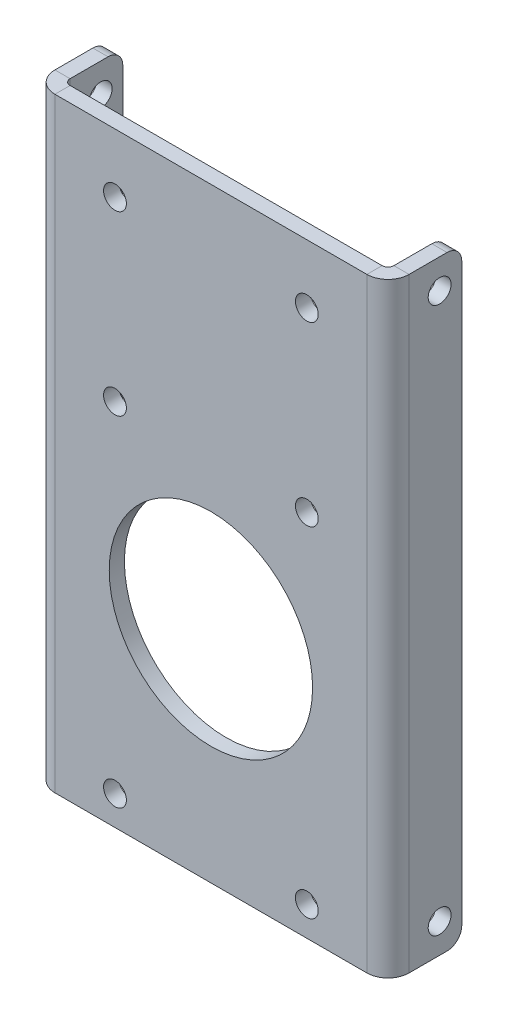
ISO-10303-21;
HEADER;
FILE_DESCRIPTION(('STEP AP214'),'2;1');
FILE_NAME('part.step','',(''),(''),'','','');
FILE_SCHEMA(('AUTOMOTIVE_DESIGN { 1 0 10303 214 1 1 1 1 }'));
ENDSEC;
DATA;
#1=APPLICATION_CONTEXT('core data for automotive mechanical design processes');
#2=APPLICATION_PROTOCOL_DEFINITION('international standard','automotive_design',2000,#1);
#3=PRODUCT_CONTEXT('',#1,'mechanical');
#4=PRODUCT('Part','Part','',(#3));
#5=PRODUCT_RELATED_PRODUCT_CATEGORY('part','',(#4));
#6=PRODUCT_DEFINITION_FORMATION('','',#4);
#7=PRODUCT_DEFINITION_CONTEXT('part definition',#1,'design');
#8=PRODUCT_DEFINITION('design','',#6,#7);
#9=PRODUCT_DEFINITION_SHAPE('','',#8);
#10=(LENGTH_UNIT() NAMED_UNIT(*) SI_UNIT(.MILLI.,.METRE.));
#11=(NAMED_UNIT(*) PLANE_ANGLE_UNIT() SI_UNIT($,.RADIAN.));
#12=(NAMED_UNIT(*) SI_UNIT($,.STERADIAN.) SOLID_ANGLE_UNIT());
#13=UNCERTAINTY_MEASURE_WITH_UNIT(LENGTH_MEASURE(1.E-05),#10,'distance_accuracy_value','');
#14=(GEOMETRIC_REPRESENTATION_CONTEXT(3) GLOBAL_UNCERTAINTY_ASSIGNED_CONTEXT((#13)) GLOBAL_UNIT_ASSIGNED_CONTEXT((#10,
#11,#12)) REPRESENTATION_CONTEXT('',''));
#15=CARTESIAN_POINT('',(0.,0.,0.));
#16=DIRECTION('',(0.,0.,1.));
#17=DIRECTION('',(1.,0.,0.));
#18=AXIS2_PLACEMENT_3D('',#15,#16,#17);
#19=CARTESIAN_POINT('',(0.,0.,-3.2639));
#20=DIRECTION('',(0.,0.,1.));
#21=DIRECTION('',(1.,0.,0.));
#22=AXIS2_PLACEMENT_3D('',#19,#20,#21);
#23=PLANE('',#22);
#24=CARTESIAN_POINT('',(-20.6375,70.146418,-3.2639));
#25=DIRECTION('',(0.,0.,1.));
#26=DIRECTION('',(1.,0.,0.));
#27=AXIS2_PLACEMENT_3D('',#24,#25,#26);
#28=CIRCLE('',#27,2.45744999999999);
#29=CARTESIAN_POINT('',(-18.18005,70.146418,-3.2639));
#30=VERTEX_POINT('',#29);
#31=EDGE_CURVE('E532',#30,#30,#28,.T.);
#32=ORIENTED_EDGE('',*,*,#31,.T.);
#33=EDGE_LOOP('',(#32));
#34=FACE_BOUND('',#33,.T.);
#35=CARTESIAN_POINT('',(20.6375,70.146418,-3.2639));
#36=DIRECTION('',(0.,0.,1.));
#37=DIRECTION('',(1.,0.,0.));
#38=AXIS2_PLACEMENT_3D('',#35,#36,#37);
#39=CIRCLE('',#38,2.45744999999999);
#40=CARTESIAN_POINT('',(23.09495,70.146418,-3.2639));
#41=VERTEX_POINT('',#40);
#42=EDGE_CURVE('E542',#41,#41,#39,.T.);
#43=ORIENTED_EDGE('',*,*,#42,.T.);
#44=EDGE_LOOP('',(#43));
#45=FACE_BOUND('',#44,.T.);
#46=CARTESIAN_POINT('',(20.6375,32.046418,-3.2639));
#47=DIRECTION('',(0.,0.,1.));
#48=DIRECTION('',(1.,0.,0.));
#49=AXIS2_PLACEMENT_3D('',#46,#47,#48);
#50=CIRCLE('',#49,2.45744999999999);
#51=CARTESIAN_POINT('',(23.09495,32.046418,-3.2639));
#52=VERTEX_POINT('',#51);
#53=EDGE_CURVE('E548',#52,#52,#50,.T.);
#54=ORIENTED_EDGE('',*,*,#53,.T.);
#55=EDGE_LOOP('',(#54));
#56=FACE_BOUND('',#55,.T.);
#57=CARTESIAN_POINT('',(-20.6375,32.046418,-3.2639));
#58=DIRECTION('',(0.,0.,1.));
#59=DIRECTION('',(1.,0.,0.));
#60=AXIS2_PLACEMENT_3D('',#57,#58,#59);
#61=CIRCLE('',#60,2.45744999999999);
#62=CARTESIAN_POINT('',(-18.18005,32.046418,-3.2639));
#63=VERTEX_POINT('',#62);
#64=EDGE_CURVE('E554',#63,#63,#61,.T.);
#65=ORIENTED_EDGE('',*,*,#64,.T.);
#66=EDGE_LOOP('',(#65));
#67=FACE_BOUND('',#66,.T.);
#68=CARTESIAN_POINT('',(-20.6375,-40.978582,-3.2639));
#69=DIRECTION('',(0.,0.,1.));
#70=DIRECTION('',(1.,0.,0.));
#71=AXIS2_PLACEMENT_3D('',#68,#69,#70);
#72=CIRCLE('',#71,2.45744999999999);
#73=CARTESIAN_POINT('',(-18.18005,-40.978582,-3.2639));
#74=VERTEX_POINT('',#73);
#75=EDGE_CURVE('E560',#74,#74,#72,.T.);
#76=ORIENTED_EDGE('',*,*,#75,.T.);
#77=EDGE_LOOP('',(#76));
#78=FACE_BOUND('',#77,.T.);
#79=CARTESIAN_POINT('',(20.6375,-40.978582,-3.2639));
#80=DIRECTION('',(0.,0.,1.));
#81=DIRECTION('',(1.,0.,0.));
#82=AXIS2_PLACEMENT_3D('',#79,#80,#81);
#83=CIRCLE('',#82,2.45744999999999);
#84=CARTESIAN_POINT('',(23.09495,-40.978582,-3.2639));
#85=VERTEX_POINT('',#84);
#86=EDGE_CURVE('E566',#85,#85,#83,.T.);
#87=ORIENTED_EDGE('',*,*,#86,.T.);
#88=EDGE_LOOP('',(#87));
#89=FACE_BOUND('',#88,.T.);
#90=CARTESIAN_POINT('',(0.,0.,-3.2639));
#91=DIRECTION('',(0.,0.,-1.));
#92=DIRECTION('',(-1.,0.,0.));
#93=AXIS2_PLACEMENT_3D('',#90,#91,#92);
#94=CIRCLE('',#93,21.87575);
#95=CARTESIAN_POINT('',(-21.87575,0.,-3.2639));
#96=VERTEX_POINT('',#95);
#97=EDGE_CURVE('E569',#96,#96,#94,.T.);
#98=ORIENTED_EDGE('',*,*,#97,.F.);
#99=EDGE_LOOP('',(#98));
#100=FACE_BOUND('',#99,.T.);
#101=DIRECTION('',(0.,1.,0.));
#102=VECTOR('',#101,1.);
#103=CARTESIAN_POINT('',(-33.5661,82.846418,-3.2639));
#104=LINE('',#103,#102);
#105=CARTESIAN_POINT('',(-33.5661,82.846418,-3.2639));
#106=VERTEX_POINT('',#105);
#107=CARTESIAN_POINT('',(-33.5661,-47.328582,-3.2639));
#108=VERTEX_POINT('',#107);
#109=EDGE_CURVE('E250',#106,#108,#104,.F.);
#110=ORIENTED_EDGE('',*,*,#109,.F.);
#111=DIRECTION('',(-1.,0.,0.));
#112=VECTOR('',#111,1.);
#113=CARTESIAN_POINT('',(-38.1,82.846418,-3.2639));
#114=LINE('',#113,#112);
#115=CARTESIAN_POINT('',(33.5661,82.846418,-3.2639));
#116=VERTEX_POINT('',#115);
#117=EDGE_CURVE('E311',#116,#106,#114,.T.);
#118=ORIENTED_EDGE('',*,*,#117,.F.);
#119=DIRECTION('',(0.,-1.,0.));
#120=VECTOR('',#119,1.);
#121=CARTESIAN_POINT('',(33.5661,-47.328582,-3.26390000000004));
#122=LINE('',#121,#120);
#123=CARTESIAN_POINT('',(33.5661,-47.328582,-3.26390000000004));
#124=VERTEX_POINT('',#123);
#125=EDGE_CURVE('E298',#124,#116,#122,.F.);
#126=ORIENTED_EDGE('',*,*,#125,.F.);
#127=DIRECTION('',(1.,0.,0.));
#128=VECTOR('',#127,1.);
#129=CARTESIAN_POINT('',(-38.1,-47.328582,-3.2639));
#130=LINE('',#129,#128);
#131=EDGE_CURVE('E308',#108,#124,#130,.T.);
#132=ORIENTED_EDGE('',*,*,#131,.F.);
#133=EDGE_LOOP('',(#110,#118,#126,#132));
#134=FACE_BOUND('',#133,.T.);
#135=ADVANCED_FACE('F83',(#34,#45,#56,#67,#78,#89,#100,#134),#23,.F.);
#136=CARTESIAN_POINT('',(0.,0.,0.));
#137=DIRECTION('',(0.,0.,1.));
#138=DIRECTION('',(1.,0.,0.));
#139=AXIS2_PLACEMENT_3D('',#136,#137,#138);
#140=PLANE('',#139);
#141=CARTESIAN_POINT('',(-20.6375,70.146418,0.));
#142=DIRECTION('',(0.,0.,1.));
#143=DIRECTION('',(1.,0.,0.));
#144=AXIS2_PLACEMENT_3D('',#141,#142,#143);
#145=CIRCLE('',#144,2.45744999999999);
#146=CARTESIAN_POINT('',(-18.18005,70.146418,0.));
#147=VERTEX_POINT('',#146);
#148=EDGE_CURVE('E535',#147,#147,#145,.T.);
#149=ORIENTED_EDGE('',*,*,#148,.F.);
#150=EDGE_LOOP('',(#149));
#151=FACE_BOUND('',#150,.T.);
#152=CARTESIAN_POINT('',(20.6375,70.146418,0.));
#153=DIRECTION('',(0.,0.,1.));
#154=DIRECTION('',(1.,0.,0.));
#155=AXIS2_PLACEMENT_3D('',#152,#153,#154);
#156=CIRCLE('',#155,2.45744999999999);
#157=CARTESIAN_POINT('',(23.09495,70.146418,0.));
#158=VERTEX_POINT('',#157);
#159=EDGE_CURVE('E537',#158,#158,#156,.T.);
#160=ORIENTED_EDGE('',*,*,#159,.F.);
#161=EDGE_LOOP('',(#160));
#162=FACE_BOUND('',#161,.T.);
#163=CARTESIAN_POINT('',(20.6375,32.046418,0.));
#164=DIRECTION('',(0.,0.,1.));
#165=DIRECTION('',(1.,0.,0.));
#166=AXIS2_PLACEMENT_3D('',#163,#164,#165);
#167=CIRCLE('',#166,2.45744999999999);
#168=CARTESIAN_POINT('',(23.09495,32.046418,0.));
#169=VERTEX_POINT('',#168);
#170=EDGE_CURVE('E545',#169,#169,#167,.T.);
#171=ORIENTED_EDGE('',*,*,#170,.F.);
#172=EDGE_LOOP('',(#171));
#173=FACE_BOUND('',#172,.T.);
#174=CARTESIAN_POINT('',(-20.6375,32.046418,0.));
#175=DIRECTION('',(0.,0.,1.));
#176=DIRECTION('',(1.,0.,0.));
#177=AXIS2_PLACEMENT_3D('',#174,#175,#176);
#178=CIRCLE('',#177,2.45744999999999);
#179=CARTESIAN_POINT('',(-18.18005,32.046418,0.));
#180=VERTEX_POINT('',#179);
#181=EDGE_CURVE('E551',#180,#180,#178,.T.);
#182=ORIENTED_EDGE('',*,*,#181,.F.);
#183=EDGE_LOOP('',(#182));
#184=FACE_BOUND('',#183,.T.);
#185=CARTESIAN_POINT('',(-20.6375,-40.978582,0.));
#186=DIRECTION('',(0.,0.,1.));
#187=DIRECTION('',(1.,0.,0.));
#188=AXIS2_PLACEMENT_3D('',#185,#186,#187);
#189=CIRCLE('',#188,2.45744999999999);
#190=CARTESIAN_POINT('',(-18.18005,-40.978582,0.));
#191=VERTEX_POINT('',#190);
#192=EDGE_CURVE('E557',#191,#191,#189,.T.);
#193=ORIENTED_EDGE('',*,*,#192,.F.);
#194=EDGE_LOOP('',(#193));
#195=FACE_BOUND('',#194,.T.);
#196=CARTESIAN_POINT('',(20.6375,-40.978582,0.));
#197=DIRECTION('',(0.,0.,1.));
#198=DIRECTION('',(1.,0.,0.));
#199=AXIS2_PLACEMENT_3D('',#196,#197,#198);
#200=CIRCLE('',#199,2.45744999999999);
#201=CARTESIAN_POINT('',(23.09495,-40.978582,0.));
#202=VERTEX_POINT('',#201);
#203=EDGE_CURVE('E563',#202,#202,#200,.T.);
#204=ORIENTED_EDGE('',*,*,#203,.F.);
#205=EDGE_LOOP('',(#204));
#206=FACE_BOUND('',#205,.T.);
#207=CARTESIAN_POINT('',(0.,0.,0.));
#208=DIRECTION('',(0.,0.,-1.));
#209=DIRECTION('',(-1.,0.,0.));
#210=AXIS2_PLACEMENT_3D('',#207,#208,#209);
#211=CIRCLE('',#210,21.87575);
#212=CARTESIAN_POINT('',(-21.87575,0.,0.));
#213=VERTEX_POINT('',#212);
#214=EDGE_CURVE('E570',#213,#213,#211,.T.);
#215=ORIENTED_EDGE('',*,*,#214,.T.);
#216=EDGE_LOOP('',(#215));
#217=FACE_BOUND('',#216,.T.);
#218=DIRECTION('',(-1.,0.,0.));
#219=VECTOR('',#218,1.);
#220=CARTESIAN_POINT('',(-38.1,82.846418,0.));
#221=LINE('',#220,#219);
#222=CARTESIAN_POINT('',(33.5661,82.846418,0.));
#223=VERTEX_POINT('',#222);
#224=CARTESIAN_POINT('',(-33.5661,82.846418,0.));
#225=VERTEX_POINT('',#224);
#226=EDGE_CURVE('E312',#223,#225,#221,.T.);
#227=ORIENTED_EDGE('',*,*,#226,.T.);
#228=DIRECTION('',(0.,1.,0.));
#229=VECTOR('',#228,1.);
#230=CARTESIAN_POINT('',(-33.5661,82.846418,0.));
#231=LINE('',#230,#229);
#232=CARTESIAN_POINT('',(-33.5661,-47.328582,0.));
#233=VERTEX_POINT('',#232);
#234=EDGE_CURVE('E217',#225,#233,#231,.F.);
#235=ORIENTED_EDGE('',*,*,#234,.T.);
#236=DIRECTION('',(1.,0.,0.));
#237=VECTOR('',#236,1.);
#238=CARTESIAN_POINT('',(-38.1,-47.328582,0.));
#239=LINE('',#238,#237);
#240=CARTESIAN_POINT('',(33.5661,-47.328582,0.));
#241=VERTEX_POINT('',#240);
#242=EDGE_CURVE('E305',#233,#241,#239,.T.);
#243=ORIENTED_EDGE('',*,*,#242,.T.);
#244=DIRECTION('',(0.,-1.,0.));
#245=VECTOR('',#244,1.);
#246=CARTESIAN_POINT('',(33.5661,-47.328582,0.));
#247=LINE('',#246,#245);
#248=EDGE_CURVE('E285',#241,#223,#247,.F.);
#249=ORIENTED_EDGE('',*,*,#248,.T.);
#250=EDGE_LOOP('',(#227,#235,#243,#249));
#251=FACE_BOUND('',#250,.T.);
#252=ADVANCED_FACE('F395',(#151,#162,#173,#184,#195,#206,#217,#251),#140,.T.);
#253=CARTESIAN_POINT('',(-38.1,82.846418,-3.2639));
#254=DIRECTION('',(0.,1.,0.));
#255=DIRECTION('',(-1.,0.,0.));
#256=AXIS2_PLACEMENT_3D('',#253,#254,#255);
#257=PLANE('',#256);
#258=ORIENTED_EDGE('',*,*,#117,.T.);
#259=DIRECTION('',(0.,0.,1.));
#260=VECTOR('',#259,1.);
#261=CARTESIAN_POINT('',(-33.5661,82.846418,-3.2639));
#262=LINE('',#261,#260);
#263=EDGE_CURVE('E246',#106,#225,#262,.T.);
#264=ORIENTED_EDGE('',*,*,#263,.T.);
#265=ORIENTED_EDGE('',*,*,#226,.F.);
#266=DIRECTION('',(0.,0.,1.));
#267=VECTOR('',#266,1.);
#268=CARTESIAN_POINT('',(33.5661,82.846418,-3.2639));
#269=LINE('',#268,#267);
#270=EDGE_CURVE('E302',#116,#223,#269,.T.);
#271=ORIENTED_EDGE('',*,*,#270,.F.);
#272=EDGE_LOOP('',(#258,#264,#265,#271));
#273=FACE_BOUND('',#272,.T.);
#274=ADVANCED_FACE('F393',(#273),#257,.T.);
#275=CARTESIAN_POINT('',(-38.1,-47.328582,-3.2639));
#276=DIRECTION('',(0.,-1.,0.));
#277=DIRECTION('',(1.,0.,0.));
#278=AXIS2_PLACEMENT_3D('',#275,#276,#277);
#279=PLANE('',#278);
#280=DIRECTION('',(0.,0.,1.));
#281=VECTOR('',#280,1.);
#282=CARTESIAN_POINT('',(-33.5661,-47.328582,-3.2639));
#283=LINE('',#282,#281);
#284=EDGE_CURVE('E253',#108,#233,#283,.T.);
#285=ORIENTED_EDGE('',*,*,#284,.F.);
#286=ORIENTED_EDGE('',*,*,#131,.T.);
#287=DIRECTION('',(0.,0.,1.));
#288=VECTOR('',#287,1.);
#289=CARTESIAN_POINT('',(33.5661,-47.328582,-3.26390000000004));
#290=LINE('',#289,#288);
#291=EDGE_CURVE('E292',#124,#241,#290,.T.);
#292=ORIENTED_EDGE('',*,*,#291,.T.);
#293=ORIENTED_EDGE('',*,*,#242,.F.);
#294=EDGE_LOOP('',(#285,#286,#292,#293));
#295=FACE_BOUND('',#294,.T.);
#296=ADVANCED_FACE('F379',(#295),#279,.T.);
#297=CARTESIAN_POINT('',(33.5661,82.846418,-4.53389999999998));
#298=DIRECTION('',(0.,1.,0.));
#299=DIRECTION('',(0.,0.,1.));
#300=AXIS2_PLACEMENT_3D('',#297,#298,#299);
#301=PLANE('',#300);
#302=DIRECTION('',(1.,0.,0.));
#303=VECTOR('',#302,1.);
#304=CARTESIAN_POINT('',(38.1,82.846418,-4.53389999999998));
#305=LINE('',#304,#303);
#306=CARTESIAN_POINT('',(34.8361,82.846418,-4.53389999999998));
#307=VERTEX_POINT('',#306);
#308=CARTESIAN_POINT('',(38.1,82.846418,-4.53389999999996));
#309=VERTEX_POINT('',#308);
#310=EDGE_CURVE('E256',#307,#309,#305,.T.);
#311=ORIENTED_EDGE('',*,*,#310,.F.);
#312=CARTESIAN_POINT('',(33.5661,82.846418,-4.53389999999998));
#313=DIRECTION('',(0.,-1.,0.));
#314=DIRECTION('',(0.,0.,-1.));
#315=AXIS2_PLACEMENT_3D('',#312,#313,#314);
#316=CIRCLE('',#315,1.26999999999999);
#317=EDGE_CURVE('E295',#116,#307,#316,.F.);
#318=ORIENTED_EDGE('',*,*,#317,.F.);
#319=ORIENTED_EDGE('',*,*,#270,.T.);
#320=CARTESIAN_POINT('',(33.5661,82.846418,-4.53389999999998));
#321=DIRECTION('',(0.,-1.,0.));
#322=DIRECTION('',(0.,0.,-1.));
#323=AXIS2_PLACEMENT_3D('',#320,#321,#322);
#324=CIRCLE('',#323,4.53389999999999);
#325=EDGE_CURVE('E288',#223,#309,#324,.F.);
#326=ORIENTED_EDGE('',*,*,#325,.T.);
#327=EDGE_LOOP('',(#311,#318,#319,#326));
#328=FACE_BOUND('',#327,.T.);
#329=ADVANCED_FACE('F390',(#328),#301,.T.);
#330=CARTESIAN_POINT('',(33.5661,-47.328582,-4.53390000000003));
#331=DIRECTION('',(0.,1.,0.));
#332=DIRECTION('',(0.,0.,1.));
#333=AXIS2_PLACEMENT_3D('',#330,#331,#332);
#334=PLANE('',#333);
#335=CARTESIAN_POINT('',(33.5661,-47.328582,-4.53390000000003));
#336=DIRECTION('',(0.,-1.,0.));
#337=DIRECTION('',(0.,0.,-1.));
#338=AXIS2_PLACEMENT_3D('',#335,#336,#337);
#339=CIRCLE('',#338,1.26999999999999);
#340=CARTESIAN_POINT('',(34.8361,-47.328582,-4.53390000000002));
#341=VERTEX_POINT('',#340);
#342=EDGE_CURVE('E260',#341,#124,#339,.T.);
#343=ORIENTED_EDGE('',*,*,#342,.F.);
#344=DIRECTION('',(1.,0.,0.));
#345=VECTOR('',#344,1.);
#346=CARTESIAN_POINT('',(34.8361,-47.328582,-4.53390000000001));
#347=LINE('',#346,#345);
#348=CARTESIAN_POINT('',(38.1,-47.328582,-4.5339));
#349=VERTEX_POINT('',#348);
#350=EDGE_CURVE('E277',#341,#349,#347,.T.);
#351=ORIENTED_EDGE('',*,*,#350,.T.);
#352=CARTESIAN_POINT('',(33.5661,-47.328582,-4.53390000000003));
#353=DIRECTION('',(0.,-1.,0.));
#354=DIRECTION('',(0.,0.,-1.));
#355=AXIS2_PLACEMENT_3D('',#352,#353,#354);
#356=CIRCLE('',#355,4.53389999999999);
#357=EDGE_CURVE('E289',#349,#241,#356,.T.);
#358=ORIENTED_EDGE('',*,*,#357,.T.);
#359=ORIENTED_EDGE('',*,*,#291,.F.);
#360=EDGE_LOOP('',(#343,#351,#358,#359));
#361=FACE_BOUND('',#360,.T.);
#362=ADVANCED_FACE('F400',(#361),#334,.F.);
#363=CARTESIAN_POINT('',(33.5661,-47.328582,-4.53390000000003));
#364=DIRECTION('',(0.,-1.,0.));
#365=DIRECTION('',(1.,0.,0.));
#366=AXIS2_PLACEMENT_3D('',#363,#364,#365);
#367=CYLINDRICAL_SURFACE('',#366,4.53389999999999);
#368=ORIENTED_EDGE('',*,*,#248,.F.);
#369=ORIENTED_EDGE('',*,*,#357,.F.);
#370=DIRECTION('',(0.,-1.,0.));
#371=VECTOR('',#370,1.);
#372=CARTESIAN_POINT('',(38.1,0.,-4.53389999999999));
#373=LINE('',#372,#371);
#374=EDGE_CURVE('E274',#309,#349,#373,.T.);
#375=ORIENTED_EDGE('',*,*,#374,.F.);
#376=ORIENTED_EDGE('',*,*,#325,.F.);
#377=EDGE_LOOP('',(#368,#369,#375,#376));
#378=FACE_BOUND('',#377,.T.);
#379=ADVANCED_FACE('F398',(#378),#367,.T.);
#380=CARTESIAN_POINT('',(33.5661,-47.328582,-4.53390000000003));
#381=DIRECTION('',(0.,-1.,0.));
#382=DIRECTION('',(1.,0.,0.));
#383=AXIS2_PLACEMENT_3D('',#380,#381,#382);
#384=CYLINDRICAL_SURFACE('',#383,1.26999999999999);
#385=ORIENTED_EDGE('',*,*,#125,.T.);
#386=ORIENTED_EDGE('',*,*,#317,.T.);
#387=DIRECTION('',(0.,1.,0.));
#388=VECTOR('',#387,1.);
#389=CARTESIAN_POINT('',(34.8361,82.846418,-4.53389999999999));
#390=LINE('',#389,#388);
#391=EDGE_CURVE('E280',#307,#341,#390,.F.);
#392=ORIENTED_EDGE('',*,*,#391,.T.);
#393=ORIENTED_EDGE('',*,*,#342,.T.);
#394=EDGE_LOOP('',(#385,#386,#392,#393));
#395=FACE_BOUND('',#394,.T.);
#396=ADVANCED_FACE('F385',(#395),#384,.F.);
#397=CARTESIAN_POINT('',(38.1,-47.328582,-3.26389999999999));
#398=DIRECTION('',(0.,-1.,0.));
#399=DIRECTION('',(1.,0.,0.));
#400=AXIS2_PLACEMENT_3D('',#397,#398,#399);
#401=PLANE('',#400);
#402=DIRECTION('',(0.,0.,-1.));
#403=VECTOR('',#402,1.);
#404=CARTESIAN_POINT('',(34.8361,-47.328582,1.46743979840938E-13));
#405=LINE('',#404,#403);
#406=CARTESIAN_POINT('',(34.8361,-47.328582,-12.7));
#407=VERTEX_POINT('',#406);
#408=EDGE_CURVE('E266',#407,#341,#405,.F.);
#409=ORIENTED_EDGE('',*,*,#408,.F.);
#410=DIRECTION('',(-1.,0.,0.));
#411=VECTOR('',#410,1.);
#412=CARTESIAN_POINT('',(38.1,-47.328582,-12.7));
#413=LINE('',#412,#411);
#414=CARTESIAN_POINT('',(38.1,-47.328582,-12.7));
#415=VERTEX_POINT('',#414);
#416=EDGE_CURVE('E13',#407,#415,#413,.F.);
#417=ORIENTED_EDGE('',*,*,#416,.T.);
#418=DIRECTION('',(0.,0.,1.));
#419=VECTOR('',#418,1.);
#420=CARTESIAN_POINT('',(38.1,-47.328582,-3.26389999999999));
#421=LINE('',#420,#419);
#422=EDGE_CURVE('E258',#415,#349,#421,.T.);
#423=ORIENTED_EDGE('',*,*,#422,.T.);
#424=ORIENTED_EDGE('',*,*,#350,.F.);
#425=EDGE_LOOP('',(#409,#417,#423,#424));
#426=FACE_BOUND('',#425,.T.);
#427=ADVANCED_FACE('F411',(#426),#401,.T.);
#428=CARTESIAN_POINT('',(38.1,82.846418,-15.875));
#429=DIRECTION('',(0.,1.,0.));
#430=DIRECTION('',(-1.,0.,0.));
#431=AXIS2_PLACEMENT_3D('',#428,#429,#430);
#432=PLANE('',#431);
#433=DIRECTION('',(0.,0.,-1.));
#434=VECTOR('',#433,1.);
#435=CARTESIAN_POINT('',(38.1,82.846418,-15.875));
#436=LINE('',#435,#434);
#437=CARTESIAN_POINT('',(38.1,82.846418,-12.7));
#438=VERTEX_POINT('',#437);
#439=EDGE_CURVE('E263',#309,#438,#436,.T.);
#440=ORIENTED_EDGE('',*,*,#439,.T.);
#441=DIRECTION('',(-1.,0.,0.));
#442=VECTOR('',#441,1.);
#443=CARTESIAN_POINT('',(38.1,82.846418,-12.7));
#444=LINE('',#443,#442);
#445=CARTESIAN_POINT('',(34.8361,82.846418,-12.7));
#446=VERTEX_POINT('',#445);
#447=EDGE_CURVE('E342',#438,#446,#444,.T.);
#448=ORIENTED_EDGE('',*,*,#447,.T.);
#449=DIRECTION('',(0.,0.,1.));
#450=VECTOR('',#449,1.);
#451=CARTESIAN_POINT('',(34.8361,82.846418,1.46743979840938E-13));
#452=LINE('',#451,#450);
#453=EDGE_CURVE('E271',#307,#446,#452,.F.);
#454=ORIENTED_EDGE('',*,*,#453,.F.);
#455=ORIENTED_EDGE('',*,*,#310,.T.);
#456=EDGE_LOOP('',(#440,#448,#454,#455));
#457=FACE_BOUND('',#456,.T.);
#458=ADVANCED_FACE('F406',(#457),#432,.T.);
#459=CARTESIAN_POINT('',(38.1,0.,1.58139825782788E-13));
#460=DIRECTION('',(1.,0.,0.));
#461=DIRECTION('',(0.,0.,-1.));
#462=AXIS2_PLACEMENT_3D('',#459,#460,#461);
#463=PLANE('',#462);
#464=CARTESIAN_POINT('',(38.1,76.496418,-11.1125));
#465=DIRECTION('',(1.,0.,0.));
#466=DIRECTION('',(0.,0.,-1.));
#467=AXIS2_PLACEMENT_3D('',#464,#465,#466);
#468=CIRCLE('',#467,2.45745);
#469=CARTESIAN_POINT('',(38.1,76.496418,-13.56995));
#470=VERTEX_POINT('',#469);
#471=EDGE_CURVE('E573',#470,#470,#468,.T.);
#472=ORIENTED_EDGE('',*,*,#471,.F.);
#473=EDGE_LOOP('',(#472));
#474=FACE_BOUND('',#473,.T.);
#475=CARTESIAN_POINT('',(38.1,-40.978582,-11.1125));
#476=DIRECTION('',(1.,0.,0.));
#477=DIRECTION('',(0.,0.,-1.));
#478=AXIS2_PLACEMENT_3D('',#475,#476,#477);
#479=CIRCLE('',#478,2.45745);
#480=CARTESIAN_POINT('',(38.1,-40.978582,-13.56995));
#481=VERTEX_POINT('',#480);
#482=EDGE_CURVE('E582',#481,#481,#479,.T.);
#483=ORIENTED_EDGE('',*,*,#482,.F.);
#484=EDGE_LOOP('',(#483));
#485=FACE_BOUND('',#484,.T.);
#486=DIRECTION('',(0.,-1.,0.));
#487=VECTOR('',#486,1.);
#488=CARTESIAN_POINT('',(38.1000000000001,-47.328582,-15.875));
#489=LINE('',#488,#487);
#490=CARTESIAN_POINT('',(38.1,79.671418,-15.875));
#491=VERTEX_POINT('',#490);
#492=CARTESIAN_POINT('',(38.1000000000001,-44.153582,-15.875));
#493=VERTEX_POINT('',#492);
#494=EDGE_CURVE('E261',#491,#493,#489,.T.);
#495=ORIENTED_EDGE('',*,*,#494,.F.);
#496=CARTESIAN_POINT('',(38.1,79.671418,-12.7));
#497=DIRECTION('',(1.,0.,0.));
#498=DIRECTION('',(0.,0.,-1.));
#499=AXIS2_PLACEMENT_3D('',#496,#497,#498);
#500=CIRCLE('',#499,3.175);
#501=EDGE_CURVE('E355',#491,#438,#500,.T.);
#502=ORIENTED_EDGE('',*,*,#501,.T.);
#503=ORIENTED_EDGE('',*,*,#439,.F.);
#504=ORIENTED_EDGE('',*,*,#374,.T.);
#505=ORIENTED_EDGE('',*,*,#422,.F.);
#506=CARTESIAN_POINT('',(38.1,-44.153582,-12.7));
#507=DIRECTION('',(1.,0.,0.));
#508=DIRECTION('',(0.,0.,-1.));
#509=AXIS2_PLACEMENT_3D('',#506,#507,#508);
#510=CIRCLE('',#509,3.175);
#511=EDGE_CURVE('E103',#415,#493,#510,.T.);
#512=ORIENTED_EDGE('',*,*,#511,.T.);
#513=EDGE_LOOP('',(#495,#502,#503,#504,#505,#512));
#514=FACE_BOUND('',#513,.T.);
#515=ADVANCED_FACE('F403',(#474,#485,#514),#463,.T.);
#516=CARTESIAN_POINT('',(34.8361,0.,1.46743979840938E-13));
#517=DIRECTION('',(1.,0.,0.));
#518=DIRECTION('',(0.,0.,-1.));
#519=AXIS2_PLACEMENT_3D('',#516,#517,#518);
#520=PLANE('',#519);
#521=CARTESIAN_POINT('',(34.8361,76.496418,-11.1125));
#522=DIRECTION('',(1.,0.,0.));
#523=DIRECTION('',(0.,0.,-1.));
#524=AXIS2_PLACEMENT_3D('',#521,#522,#523);
#525=CIRCLE('',#524,2.45744999999999);
#526=CARTESIAN_POINT('',(34.8361,76.496418,-13.56995));
#527=VERTEX_POINT('',#526);
#528=EDGE_CURVE('E327',#527,#527,#525,.T.);
#529=ORIENTED_EDGE('',*,*,#528,.T.);
#530=EDGE_LOOP('',(#529));
#531=FACE_BOUND('',#530,.T.);
#532=CARTESIAN_POINT('',(34.8361,-40.978582,-11.1125));
#533=DIRECTION('',(1.,0.,0.));
#534=DIRECTION('',(0.,0.,-1.));
#535=AXIS2_PLACEMENT_3D('',#532,#533,#534);
#536=CIRCLE('',#535,2.45744999999999);
#537=CARTESIAN_POINT('',(34.8361,-40.978582,-13.56995));
#538=VERTEX_POINT('',#537);
#539=EDGE_CURVE('E320',#538,#538,#536,.T.);
#540=ORIENTED_EDGE('',*,*,#539,.T.);
#541=EDGE_LOOP('',(#540));
#542=FACE_BOUND('',#541,.T.);
#543=ORIENTED_EDGE('',*,*,#453,.T.);
#544=CARTESIAN_POINT('',(34.8361,79.671418,-12.7));
#545=DIRECTION('',(1.,0.,0.));
#546=DIRECTION('',(0.,0.,-1.));
#547=AXIS2_PLACEMENT_3D('',#544,#545,#546);
#548=CIRCLE('',#547,3.175);
#549=CARTESIAN_POINT('',(34.8361,79.671418,-15.875));
#550=VERTEX_POINT('',#549);
#551=EDGE_CURVE('E347',#446,#550,#548,.F.);
#552=ORIENTED_EDGE('',*,*,#551,.T.);
#553=DIRECTION('',(0.,1.,0.));
#554=VECTOR('',#553,1.);
#555=CARTESIAN_POINT('',(34.8361000000001,0.,-15.875));
#556=LINE('',#555,#554);
#557=CARTESIAN_POINT('',(34.8361000000001,-44.153582,-15.875));
#558=VERTEX_POINT('',#557);
#559=EDGE_CURVE('E268',#550,#558,#556,.F.);
#560=ORIENTED_EDGE('',*,*,#559,.T.);
#561=CARTESIAN_POINT('',(34.8361,-44.153582,-12.7));
#562=DIRECTION('',(1.,0.,0.));
#563=DIRECTION('',(0.,0.,-1.));
#564=AXIS2_PLACEMENT_3D('',#561,#562,#563);
#565=CIRCLE('',#564,3.175);
#566=EDGE_CURVE('E345',#558,#407,#565,.F.);
#567=ORIENTED_EDGE('',*,*,#566,.T.);
#568=ORIENTED_EDGE('',*,*,#408,.T.);
#569=ORIENTED_EDGE('',*,*,#391,.F.);
#570=EDGE_LOOP('',(#543,#552,#560,#567,#568,#569));
#571=FACE_BOUND('',#570,.T.);
#572=ADVANCED_FACE('F409',(#531,#542,#571),#520,.F.);
#573=CARTESIAN_POINT('',(38.1000000000001,-47.328582,-15.875));
#574=DIRECTION('',(0.,0.,-1.));
#575=DIRECTION('',(-1.,0.,0.));
#576=AXIS2_PLACEMENT_3D('',#573,#574,#575);
#577=PLANE('',#576);
#578=ORIENTED_EDGE('',*,*,#559,.F.);
#579=DIRECTION('',(-1.,0.,0.));
#580=VECTOR('',#579,1.);
#581=CARTESIAN_POINT('',(38.1,79.671418,-15.875));
#582=LINE('',#581,#580);
#583=EDGE_CURVE('E352',#550,#491,#582,.F.);
#584=ORIENTED_EDGE('',*,*,#583,.T.);
#585=ORIENTED_EDGE('',*,*,#494,.T.);
#586=DIRECTION('',(-1.,0.,0.));
#587=VECTOR('',#586,1.);
#588=CARTESIAN_POINT('',(38.1000000000001,-44.153582,-15.875));
#589=LINE('',#588,#587);
#590=EDGE_CURVE('E349',#493,#558,#589,.T.);
#591=ORIENTED_EDGE('',*,*,#590,.T.);
#592=EDGE_LOOP('',(#578,#584,#585,#591));
#593=FACE_BOUND('',#592,.T.);
#594=ADVANCED_FACE('F415',(#593),#577,.T.);
#595=CARTESIAN_POINT('',(-33.5661,-47.328582,-4.5339));
#596=DIRECTION('',(0.,-1.,0.));
#597=DIRECTION('',(0.,0.,-1.));
#598=AXIS2_PLACEMENT_3D('',#595,#596,#597);
#599=PLANE('',#598);
#600=DIRECTION('',(-1.,0.,0.));
#601=VECTOR('',#600,1.);
#602=CARTESIAN_POINT('',(-38.1,-47.328582,-4.53389999999998));
#603=LINE('',#602,#601);
#604=CARTESIAN_POINT('',(-34.8361,-47.328582,-4.53389999999999));
#605=VERTEX_POINT('',#604);
#606=CARTESIAN_POINT('',(-38.1,-47.328582,-4.53389999999998));
#607=VERTEX_POINT('',#606);
#608=EDGE_CURVE('E240',#605,#607,#603,.T.);
#609=ORIENTED_EDGE('',*,*,#608,.F.);
#610=CARTESIAN_POINT('',(-33.5661,-47.328582,-4.5339));
#611=DIRECTION('',(0.,1.,0.));
#612=DIRECTION('',(0.,0.,1.));
#613=AXIS2_PLACEMENT_3D('',#610,#611,#612);
#614=CIRCLE('',#613,1.26999999999999);
#615=EDGE_CURVE('E220',#108,#605,#614,.F.);
#616=ORIENTED_EDGE('',*,*,#615,.F.);
#617=ORIENTED_EDGE('',*,*,#284,.T.);
#618=CARTESIAN_POINT('',(-33.5661,-47.328582,-4.5339));
#619=DIRECTION('',(0.,1.,0.));
#620=DIRECTION('',(0.,0.,1.));
#621=AXIS2_PLACEMENT_3D('',#618,#619,#620);
#622=CIRCLE('',#621,4.53389999999999);
#623=EDGE_CURVE('E245',#233,#607,#622,.F.);
#624=ORIENTED_EDGE('',*,*,#623,.T.);
#625=EDGE_LOOP('',(#609,#616,#617,#624));
#626=FACE_BOUND('',#625,.T.);
#627=ADVANCED_FACE('F375',(#626),#599,.T.);
#628=CARTESIAN_POINT('',(-33.5661,82.846418,-4.5339));
#629=DIRECTION('',(0.,-1.,0.));
#630=DIRECTION('',(0.,0.,-1.));
#631=AXIS2_PLACEMENT_3D('',#628,#629,#630);
#632=PLANE('',#631);
#633=CARTESIAN_POINT('',(-33.5661,82.846418,-4.5339));
#634=DIRECTION('',(0.,1.,0.));
#635=DIRECTION('',(0.,0.,1.));
#636=AXIS2_PLACEMENT_3D('',#633,#634,#635);
#637=CIRCLE('',#636,1.26999999999999);
#638=CARTESIAN_POINT('',(-34.8361,82.846418,-4.53389999999999));
#639=VERTEX_POINT('',#638);
#640=EDGE_CURVE('E207',#639,#106,#637,.T.);
#641=ORIENTED_EDGE('',*,*,#640,.F.);
#642=DIRECTION('',(-1.,0.,0.));
#643=VECTOR('',#642,1.);
#644=CARTESIAN_POINT('',(-34.8361,82.846418,-4.53389999999999));
#645=LINE('',#644,#643);
#646=CARTESIAN_POINT('',(-38.1,82.846418,-4.53389999999997));
#647=VERTEX_POINT('',#646);
#648=EDGE_CURVE('E201',#639,#647,#645,.T.);
#649=ORIENTED_EDGE('',*,*,#648,.T.);
#650=CARTESIAN_POINT('',(-33.5661,82.846418,-4.5339));
#651=DIRECTION('',(0.,1.,0.));
#652=DIRECTION('',(0.,0.,1.));
#653=AXIS2_PLACEMENT_3D('',#650,#651,#652);
#654=CIRCLE('',#653,4.53389999999999);
#655=EDGE_CURVE('E212',#647,#225,#654,.T.);
#656=ORIENTED_EDGE('',*,*,#655,.T.);
#657=ORIENTED_EDGE('',*,*,#263,.F.);
#658=EDGE_LOOP('',(#641,#649,#656,#657));
#659=FACE_BOUND('',#658,.T.);
#660=ADVANCED_FACE('F223',(#659),#632,.F.);
#661=CARTESIAN_POINT('',(-33.5661,82.846418,-4.5339));
#662=DIRECTION('',(0.,1.,0.));
#663=DIRECTION('',(-1.,0.,0.));
#664=AXIS2_PLACEMENT_3D('',#661,#662,#663);
#665=CYLINDRICAL_SURFACE('',#664,4.53389999999999);
#666=ORIENTED_EDGE('',*,*,#234,.F.);
#667=ORIENTED_EDGE('',*,*,#655,.F.);
#668=DIRECTION('',(0.,1.,0.));
#669=VECTOR('',#668,1.);
#670=CARTESIAN_POINT('',(-38.1,-47.328582,-4.53389999999998));
#671=LINE('',#670,#669);
#672=EDGE_CURVE('E214',#647,#607,#671,.F.);
#673=ORIENTED_EDGE('',*,*,#672,.T.);
#674=ORIENTED_EDGE('',*,*,#623,.F.);
#675=EDGE_LOOP('',(#666,#667,#673,#674));
#676=FACE_BOUND('',#675,.T.);
#677=ADVANCED_FACE('F213',(#676),#665,.T.);
#678=CARTESIAN_POINT('',(-33.5661,82.846418,-4.5339));
#679=DIRECTION('',(0.,1.,0.));
#680=DIRECTION('',(-1.,0.,0.));
#681=AXIS2_PLACEMENT_3D('',#678,#679,#680);
#682=CYLINDRICAL_SURFACE('',#681,1.26999999999999);
#683=ORIENTED_EDGE('',*,*,#109,.T.);
#684=ORIENTED_EDGE('',*,*,#615,.T.);
#685=DIRECTION('',(0.,1.,0.));
#686=VECTOR('',#685,1.);
#687=CARTESIAN_POINT('',(-34.8361,-47.328582,-4.53389999999999));
#688=LINE('',#687,#686);
#689=EDGE_CURVE('E225',#605,#639,#688,.T.);
#690=ORIENTED_EDGE('',*,*,#689,.T.);
#691=ORIENTED_EDGE('',*,*,#640,.T.);
#692=EDGE_LOOP('',(#683,#684,#690,#691));
#693=FACE_BOUND('',#692,.T.);
#694=ADVANCED_FACE('F370',(#693),#682,.F.);
#695=CARTESIAN_POINT('',(-38.1,-47.328582,-3.26389999999999));
#696=DIRECTION('',(0.,-1.,0.));
#697=DIRECTION('',(1.,0.,0.));
#698=AXIS2_PLACEMENT_3D('',#695,#696,#697);
#699=PLANE('',#698);
#700=DIRECTION('',(0.,0.,1.));
#701=VECTOR('',#700,1.);
#702=CARTESIAN_POINT('',(-38.1,-47.328582,-3.26389999999999));
#703=LINE('',#702,#701);
#704=CARTESIAN_POINT('',(-38.1,-47.328582,-12.7));
#705=VERTEX_POINT('',#704);
#706=EDGE_CURVE('E230',#607,#705,#703,.F.);
#707=ORIENTED_EDGE('',*,*,#706,.T.);
#708=DIRECTION('',(1.,0.,0.));
#709=VECTOR('',#708,1.);
#710=CARTESIAN_POINT('',(-38.1,-47.328582,-12.7));
#711=LINE('',#710,#709);
#712=CARTESIAN_POINT('',(-34.8361,-47.328582,-12.7));
#713=VERTEX_POINT('',#712);
#714=EDGE_CURVE('E91',#705,#713,#711,.T.);
#715=ORIENTED_EDGE('',*,*,#714,.T.);
#716=DIRECTION('',(0.,0.,-1.));
#717=VECTOR('',#716,1.);
#718=CARTESIAN_POINT('',(-34.8361,-47.328582,1.46743979840938E-13));
#719=LINE('',#718,#717);
#720=EDGE_CURVE('E231',#605,#713,#719,.T.);
#721=ORIENTED_EDGE('',*,*,#720,.F.);
#722=ORIENTED_EDGE('',*,*,#608,.T.);
#723=EDGE_LOOP('',(#707,#715,#721,#722));
#724=FACE_BOUND('',#723,.T.);
#725=ADVANCED_FACE('F360',(#724),#699,.T.);
#726=CARTESIAN_POINT('',(-38.1000000000001,82.846418,-15.875));
#727=DIRECTION('',(0.,1.,0.));
#728=DIRECTION('',(-1.,0.,0.));
#729=AXIS2_PLACEMENT_3D('',#726,#727,#728);
#730=PLANE('',#729);
#731=DIRECTION('',(0.,0.,1.));
#732=VECTOR('',#731,1.);
#733=CARTESIAN_POINT('',(-34.8361,82.846418,1.46743979840938E-13));
#734=LINE('',#733,#732);
#735=CARTESIAN_POINT('',(-34.8361,82.846418,-12.7));
#736=VERTEX_POINT('',#735);
#737=EDGE_CURVE('E368',#736,#639,#734,.T.);
#738=ORIENTED_EDGE('',*,*,#737,.F.);
#739=DIRECTION('',(1.,0.,0.));
#740=VECTOR('',#739,1.);
#741=CARTESIAN_POINT('',(-38.1,82.846418,-12.7));
#742=LINE('',#741,#740);
#743=CARTESIAN_POINT('',(-38.1,82.846418,-12.7));
#744=VERTEX_POINT('',#743);
#745=EDGE_CURVE('E203',#736,#744,#742,.F.);
#746=ORIENTED_EDGE('',*,*,#745,.T.);
#747=DIRECTION('',(0.,0.,-1.));
#748=VECTOR('',#747,1.);
#749=CARTESIAN_POINT('',(-38.1000000000001,82.846418,-15.875));
#750=LINE('',#749,#748);
#751=EDGE_CURVE('E196',#744,#647,#750,.F.);
#752=ORIENTED_EDGE('',*,*,#751,.T.);
#753=ORIENTED_EDGE('',*,*,#648,.F.);
#754=EDGE_LOOP('',(#738,#746,#752,#753));
#755=FACE_BOUND('',#754,.T.);
#756=ADVANCED_FACE('F199',(#755),#730,.T.);
#757=CARTESIAN_POINT('',(-38.1,0.,1.58139825782788E-13));
#758=DIRECTION('',(1.,0.,0.));
#759=DIRECTION('',(0.,0.,-1.));
#760=AXIS2_PLACEMENT_3D('',#757,#758,#759);
#761=PLANE('',#760);
#762=CARTESIAN_POINT('',(-38.1000000000001,76.496418,-11.1125000000003));
#763=DIRECTION('',(1.,0.,0.));
#764=DIRECTION('',(0.,0.,-1.));
#765=AXIS2_PLACEMENT_3D('',#762,#763,#764);
#766=CIRCLE('',#765,2.45744999999999);
#767=CARTESIAN_POINT('',(-38.1000000000001,76.496418,-13.5699500000003));
#768=VERTEX_POINT('',#767);
#769=EDGE_CURVE('E328',#768,#768,#766,.T.);
#770=ORIENTED_EDGE('',*,*,#769,.T.);
#771=EDGE_LOOP('',(#770));
#772=FACE_BOUND('',#771,.T.);
#773=CARTESIAN_POINT('',(-38.1000000000001,-40.978582,-11.1125000000003));
#774=DIRECTION('',(1.,0.,0.));
#775=DIRECTION('',(0.,0.,-1.));
#776=AXIS2_PLACEMENT_3D('',#773,#774,#775);
#777=CIRCLE('',#776,2.45744999999999);
#778=CARTESIAN_POINT('',(-38.1000000000001,-40.978582,-13.5699500000003));
#779=VERTEX_POINT('',#778);
#780=EDGE_CURVE('E323',#779,#779,#777,.T.);
#781=ORIENTED_EDGE('',*,*,#780,.T.);
#782=EDGE_LOOP('',(#781));
#783=FACE_BOUND('',#782,.T.);
#784=ORIENTED_EDGE('',*,*,#751,.F.);
#785=CARTESIAN_POINT('',(-38.1,79.6714179999999,-12.7));
#786=DIRECTION('',(1.,0.,0.));
#787=DIRECTION('',(0.,0.,-1.));
#788=AXIS2_PLACEMENT_3D('',#785,#786,#787);
#789=CIRCLE('',#788,3.175);
#790=CARTESIAN_POINT('',(-38.1000000000001,79.6714179999999,-15.875));
#791=VERTEX_POINT('',#790);
#792=EDGE_CURVE('E340',#744,#791,#789,.F.);
#793=ORIENTED_EDGE('',*,*,#792,.T.);
#794=DIRECTION('',(0.,-1.,0.));
#795=VECTOR('',#794,1.);
#796=CARTESIAN_POINT('',(-38.1,-47.328582,-15.875));
#797=LINE('',#796,#795);
#798=CARTESIAN_POINT('',(-38.1,-44.153582,-15.875));
#799=VERTEX_POINT('',#798);
#800=EDGE_CURVE('E208',#799,#791,#797,.F.);
#801=ORIENTED_EDGE('',*,*,#800,.F.);
#802=CARTESIAN_POINT('',(-38.1,-44.153582,-12.7));
#803=DIRECTION('',(1.,0.,0.));
#804=DIRECTION('',(0.,0.,-1.));
#805=AXIS2_PLACEMENT_3D('',#802,#803,#804);
#806=CIRCLE('',#805,3.175);
#807=EDGE_CURVE('E338',#799,#705,#806,.F.);
#808=ORIENTED_EDGE('',*,*,#807,.T.);
#809=ORIENTED_EDGE('',*,*,#706,.F.);
#810=ORIENTED_EDGE('',*,*,#672,.F.);
#811=EDGE_LOOP('',(#784,#793,#801,#808,#809,#810));
#812=FACE_BOUND('',#811,.T.);
#813=ADVANCED_FACE('F228',(#772,#783,#812),#761,.F.);
#814=CARTESIAN_POINT('',(-34.8361,0.,1.46743979840938E-13));
#815=DIRECTION('',(1.,0.,0.));
#816=DIRECTION('',(0.,0.,-1.));
#817=AXIS2_PLACEMENT_3D('',#814,#815,#816);
#818=PLANE('',#817);
#819=CARTESIAN_POINT('',(-34.8361,76.496418,-11.1125000000003));
#820=DIRECTION('',(1.,0.,0.));
#821=DIRECTION('',(0.,0.,-1.));
#822=AXIS2_PLACEMENT_3D('',#819,#820,#821);
#823=CIRCLE('',#822,2.45744999999999);
#824=CARTESIAN_POINT('',(-34.8361000000001,76.496418,-13.5699500000003));
#825=VERTEX_POINT('',#824);
#826=EDGE_CURVE('E324',#825,#825,#823,.T.);
#827=ORIENTED_EDGE('',*,*,#826,.F.);
#828=EDGE_LOOP('',(#827));
#829=FACE_BOUND('',#828,.T.);
#830=CARTESIAN_POINT('',(-34.8361,-40.978582,-11.1125000000003));
#831=DIRECTION('',(1.,0.,0.));
#832=DIRECTION('',(0.,0.,-1.));
#833=AXIS2_PLACEMENT_3D('',#830,#831,#832);
#834=CIRCLE('',#833,2.45744999999999);
#835=CARTESIAN_POINT('',(-34.8361,-40.978582,-13.5699500000003));
#836=VERTEX_POINT('',#835);
#837=EDGE_CURVE('E243',#836,#836,#834,.T.);
#838=ORIENTED_EDGE('',*,*,#837,.F.);
#839=EDGE_LOOP('',(#838));
#840=FACE_BOUND('',#839,.T.);
#841=DIRECTION('',(0.,1.,0.));
#842=VECTOR('',#841,1.);
#843=CARTESIAN_POINT('',(-34.8361000000001,0.,-15.875));
#844=LINE('',#843,#842);
#845=CARTESIAN_POINT('',(-34.8361,-44.153582,-15.875));
#846=VERTEX_POINT('',#845);
#847=CARTESIAN_POINT('',(-34.8361000000001,79.6714179999999,-15.875));
#848=VERTEX_POINT('',#847);
#849=EDGE_CURVE('E234',#846,#848,#844,.T.);
#850=ORIENTED_EDGE('',*,*,#849,.T.);
#851=CARTESIAN_POINT('',(-34.8361,79.6714179999999,-12.7));
#852=DIRECTION('',(1.,0.,0.));
#853=DIRECTION('',(0.,0.,-1.));
#854=AXIS2_PLACEMENT_3D('',#851,#852,#853);
#855=CIRCLE('',#854,3.175);
#856=EDGE_CURVE('E335',#848,#736,#855,.T.);
#857=ORIENTED_EDGE('',*,*,#856,.T.);
#858=ORIENTED_EDGE('',*,*,#737,.T.);
#859=ORIENTED_EDGE('',*,*,#689,.F.);
#860=ORIENTED_EDGE('',*,*,#720,.T.);
#861=CARTESIAN_POINT('',(-34.8361,-44.153582,-12.7));
#862=DIRECTION('',(1.,0.,0.));
#863=DIRECTION('',(0.,0.,-1.));
#864=AXIS2_PLACEMENT_3D('',#861,#862,#863);
#865=CIRCLE('',#864,3.175);
#866=EDGE_CURVE('E333',#713,#846,#865,.T.);
#867=ORIENTED_EDGE('',*,*,#866,.T.);
#868=EDGE_LOOP('',(#850,#857,#858,#859,#860,#867));
#869=FACE_BOUND('',#868,.T.);
#870=ADVANCED_FACE('F366',(#829,#840,#869),#818,.T.);
#871=CARTESIAN_POINT('',(-38.1,-47.328582,-15.875));
#872=DIRECTION('',(0.,0.,-1.));
#873=DIRECTION('',(-1.,0.,0.));
#874=AXIS2_PLACEMENT_3D('',#871,#872,#873);
#875=PLANE('',#874);
#876=ORIENTED_EDGE('',*,*,#800,.T.);
#877=DIRECTION('',(1.,0.,0.));
#878=VECTOR('',#877,1.);
#879=CARTESIAN_POINT('',(-38.1000000000001,79.6714179999999,-15.875));
#880=LINE('',#879,#878);
#881=EDGE_CURVE('E330',#791,#848,#880,.T.);
#882=ORIENTED_EDGE('',*,*,#881,.T.);
#883=ORIENTED_EDGE('',*,*,#849,.F.);
#884=DIRECTION('',(1.,0.,0.));
#885=VECTOR('',#884,1.);
#886=CARTESIAN_POINT('',(-38.1,-44.153582,-15.875));
#887=LINE('',#886,#885);
#888=EDGE_CURVE('E315',#846,#799,#887,.F.);
#889=ORIENTED_EDGE('',*,*,#888,.T.);
#890=EDGE_LOOP('',(#876,#882,#883,#889));
#891=FACE_BOUND('',#890,.T.);
#892=ADVANCED_FACE('F480',(#891),#875,.T.);
#893=CARTESIAN_POINT('',(38.1,-40.978582,-11.1125));
#894=DIRECTION('',(1.,0.,0.));
#895=DIRECTION('',(0.,0.,-1.));
#896=AXIS2_PLACEMENT_3D('',#893,#894,#895);
#897=CYLINDRICAL_SURFACE('',#896,2.45744999999999);
#898=ORIENTED_EDGE('',*,*,#482,.T.);
#899=EDGE_LOOP('',(#898));
#900=FACE_BOUND('',#899,.T.);
#901=ORIENTED_EDGE('',*,*,#539,.F.);
#902=EDGE_LOOP('',(#901));
#903=FACE_BOUND('',#902,.T.);
#904=ADVANCED_FACE('F483',(#900,#903),#897,.F.);
#905=ORIENTED_EDGE('',*,*,#837,.T.);
#906=EDGE_LOOP('',(#905));
#907=FACE_BOUND('',#906,.T.);
#908=ORIENTED_EDGE('',*,*,#780,.F.);
#909=EDGE_LOOP('',(#908));
#910=FACE_BOUND('',#909,.T.);
#911=ADVANCED_FACE('F493',(#907,#910),#897,.F.);
#912=CARTESIAN_POINT('',(38.1,76.496418,-11.1125));
#913=DIRECTION('',(1.,0.,0.));
#914=DIRECTION('',(0.,0.,-1.));
#915=AXIS2_PLACEMENT_3D('',#912,#913,#914);
#916=CYLINDRICAL_SURFACE('',#915,2.45744999999999);
#917=ORIENTED_EDGE('',*,*,#826,.T.);
#918=EDGE_LOOP('',(#917));
#919=FACE_BOUND('',#918,.T.);
#920=ORIENTED_EDGE('',*,*,#769,.F.);
#921=EDGE_LOOP('',(#920));
#922=FACE_BOUND('',#921,.T.);
#923=ADVANCED_FACE('F496',(#919,#922),#916,.F.);
#924=ORIENTED_EDGE('',*,*,#471,.T.);
#925=EDGE_LOOP('',(#924));
#926=FACE_BOUND('',#925,.T.);
#927=ORIENTED_EDGE('',*,*,#528,.F.);
#928=EDGE_LOOP('',(#927));
#929=FACE_BOUND('',#928,.T.);
#930=ADVANCED_FACE('F500',(#926,#929),#916,.F.);
#931=CARTESIAN_POINT('',(0.,0.,0.));
#932=DIRECTION('',(0.,0.,-1.));
#933=DIRECTION('',(-1.,0.,0.));
#934=AXIS2_PLACEMENT_3D('',#931,#932,#933);
#935=CYLINDRICAL_SURFACE('',#934,21.87575);
#936=ORIENTED_EDGE('',*,*,#214,.F.);
#937=EDGE_LOOP('',(#936));
#938=FACE_BOUND('',#937,.T.);
#939=ORIENTED_EDGE('',*,*,#97,.T.);
#940=EDGE_LOOP('',(#939));
#941=FACE_BOUND('',#940,.T.);
#942=ADVANCED_FACE('F502',(#938,#941),#935,.F.);
#943=CARTESIAN_POINT('',(20.6375,-40.978582,0.));
#944=DIRECTION('',(0.,0.,1.));
#945=DIRECTION('',(1.,0.,0.));
#946=AXIS2_PLACEMENT_3D('',#943,#944,#945);
#947=CYLINDRICAL_SURFACE('',#946,2.45744999999999);
#948=ORIENTED_EDGE('',*,*,#86,.F.);
#949=EDGE_LOOP('',(#948));
#950=FACE_BOUND('',#949,.T.);
#951=ORIENTED_EDGE('',*,*,#203,.T.);
#952=EDGE_LOOP('',(#951));
#953=FACE_BOUND('',#952,.T.);
#954=ADVANCED_FACE('F505',(#950,#953),#947,.F.);
#955=CARTESIAN_POINT('',(-20.6375,-40.978582,0.));
#956=DIRECTION('',(0.,0.,1.));
#957=DIRECTION('',(1.,0.,0.));
#958=AXIS2_PLACEMENT_3D('',#955,#956,#957);
#959=CYLINDRICAL_SURFACE('',#958,2.45744999999999);
#960=ORIENTED_EDGE('',*,*,#75,.F.);
#961=EDGE_LOOP('',(#960));
#962=FACE_BOUND('',#961,.T.);
#963=ORIENTED_EDGE('',*,*,#192,.T.);
#964=EDGE_LOOP('',(#963));
#965=FACE_BOUND('',#964,.T.);
#966=ADVANCED_FACE('F428',(#962,#965),#959,.F.);
#967=CARTESIAN_POINT('',(-38.1,79.6714179999999,-12.7));
#968=DIRECTION('',(1.,0.,0.));
#969=DIRECTION('',(0.,0.,-1.));
#970=AXIS2_PLACEMENT_3D('',#967,#968,#969);
#971=CYLINDRICAL_SURFACE('',#970,3.175);
#972=ORIENTED_EDGE('',*,*,#792,.F.);
#973=ORIENTED_EDGE('',*,*,#745,.F.);
#974=ORIENTED_EDGE('',*,*,#856,.F.);
#975=ORIENTED_EDGE('',*,*,#881,.F.);
#976=EDGE_LOOP('',(#972,#973,#974,#975));
#977=FACE_BOUND('',#976,.T.);
#978=ADVANCED_FACE('F422',(#977),#971,.T.);
#979=CARTESIAN_POINT('',(38.1,79.671418,-12.7));
#980=DIRECTION('',(-1.,0.,0.));
#981=DIRECTION('',(0.,0.,1.));
#982=AXIS2_PLACEMENT_3D('',#979,#980,#981);
#983=CYLINDRICAL_SURFACE('',#982,3.175);
#984=ORIENTED_EDGE('',*,*,#501,.F.);
#985=ORIENTED_EDGE('',*,*,#583,.F.);
#986=ORIENTED_EDGE('',*,*,#551,.F.);
#987=ORIENTED_EDGE('',*,*,#447,.F.);
#988=EDGE_LOOP('',(#984,#985,#986,#987));
#989=FACE_BOUND('',#988,.T.);
#990=ADVANCED_FACE('F419',(#989),#983,.T.);
#991=CARTESIAN_POINT('',(-38.1,-44.153582,-12.7));
#992=DIRECTION('',(1.,0.,0.));
#993=DIRECTION('',(0.,0.,-1.));
#994=AXIS2_PLACEMENT_3D('',#991,#992,#993);
#995=CYLINDRICAL_SURFACE('',#994,3.175);
#996=ORIENTED_EDGE('',*,*,#807,.F.);
#997=ORIENTED_EDGE('',*,*,#888,.F.);
#998=ORIENTED_EDGE('',*,*,#866,.F.);
#999=ORIENTED_EDGE('',*,*,#714,.F.);
#1000=EDGE_LOOP('',(#996,#997,#998,#999));
#1001=FACE_BOUND('',#1000,.T.);
#1002=ADVANCED_FACE('F421',(#1001),#995,.T.);
#1003=CARTESIAN_POINT('',(38.1,-44.153582,-12.7));
#1004=DIRECTION('',(-1.,0.,0.));
#1005=DIRECTION('',(0.,0.,1.));
#1006=AXIS2_PLACEMENT_3D('',#1003,#1004,#1005);
#1007=CYLINDRICAL_SURFACE('',#1006,3.175);
#1008=ORIENTED_EDGE('',*,*,#511,.F.);
#1009=ORIENTED_EDGE('',*,*,#416,.F.);
#1010=ORIENTED_EDGE('',*,*,#566,.F.);
#1011=ORIENTED_EDGE('',*,*,#590,.F.);
#1012=EDGE_LOOP('',(#1008,#1009,#1010,#1011));
#1013=FACE_BOUND('',#1012,.T.);
#1014=ADVANCED_FACE('F85',(#1013),#1007,.T.);
#1015=CARTESIAN_POINT('',(-20.6375,32.046418,0.));
#1016=DIRECTION('',(0.,0.,1.));
#1017=DIRECTION('',(1.,0.,0.));
#1018=AXIS2_PLACEMENT_3D('',#1015,#1016,#1017);
#1019=CYLINDRICAL_SURFACE('',#1018,2.45744999999999);
#1020=ORIENTED_EDGE('',*,*,#64,.F.);
#1021=EDGE_LOOP('',(#1020));
#1022=FACE_BOUND('',#1021,.T.);
#1023=ORIENTED_EDGE('',*,*,#181,.T.);
#1024=EDGE_LOOP('',(#1023));
#1025=FACE_BOUND('',#1024,.T.);
#1026=ADVANCED_FACE('F513',(#1022,#1025),#1019,.F.);
#1027=CARTESIAN_POINT('',(20.6375,32.046418,0.));
#1028=DIRECTION('',(0.,0.,1.));
#1029=DIRECTION('',(1.,0.,0.));
#1030=AXIS2_PLACEMENT_3D('',#1027,#1028,#1029);
#1031=CYLINDRICAL_SURFACE('',#1030,2.45744999999999);
#1032=ORIENTED_EDGE('',*,*,#53,.F.);
#1033=EDGE_LOOP('',(#1032));
#1034=FACE_BOUND('',#1033,.T.);
#1035=ORIENTED_EDGE('',*,*,#170,.T.);
#1036=EDGE_LOOP('',(#1035));
#1037=FACE_BOUND('',#1036,.T.);
#1038=ADVANCED_FACE('F516',(#1034,#1037),#1031,.F.);
#1039=CARTESIAN_POINT('',(20.6375,70.146418,0.));
#1040=DIRECTION('',(0.,0.,1.));
#1041=DIRECTION('',(1.,0.,0.));
#1042=AXIS2_PLACEMENT_3D('',#1039,#1040,#1041);
#1043=CYLINDRICAL_SURFACE('',#1042,2.45744999999999);
#1044=ORIENTED_EDGE('',*,*,#42,.F.);
#1045=EDGE_LOOP('',(#1044));
#1046=FACE_BOUND('',#1045,.T.);
#1047=ORIENTED_EDGE('',*,*,#159,.T.);
#1048=EDGE_LOOP('',(#1047));
#1049=FACE_BOUND('',#1048,.T.);
#1050=ADVANCED_FACE('F520',(#1046,#1049),#1043,.F.);
#1051=CARTESIAN_POINT('',(-20.6375,70.146418,0.));
#1052=DIRECTION('',(0.,0.,1.));
#1053=DIRECTION('',(1.,0.,0.));
#1054=AXIS2_PLACEMENT_3D('',#1051,#1052,#1053);
#1055=CYLINDRICAL_SURFACE('',#1054,2.45744999999999);
#1056=ORIENTED_EDGE('',*,*,#31,.F.);
#1057=EDGE_LOOP('',(#1056));
#1058=FACE_BOUND('',#1057,.T.);
#1059=ORIENTED_EDGE('',*,*,#148,.T.);
#1060=EDGE_LOOP('',(#1059));
#1061=FACE_BOUND('',#1060,.T.);
#1062=ADVANCED_FACE('F524',(#1058,#1061),#1055,.F.);
#1063=CLOSED_SHELL('',(#135,#252,#274,#296,#329,#362,#379,#396,#427,#458,#515,#572,#594,#627,
#660,#677,#694,#725,#756,#813,#870,#892,#904,#911,#923,#930,#942,#954,#966,#978,#990,#1002,
#1014,#1026,#1038,#1050,#1062));
#1064=MANIFOLD_SOLID_BREP('B2',#1063);
#1065=ADVANCED_BREP_SHAPE_REPRESENTATION('',(#18,#1064),#14);
#1066=SHAPE_DEFINITION_REPRESENTATION(#9,#1065);
ENDSEC;
END-ISO-10303-21;
